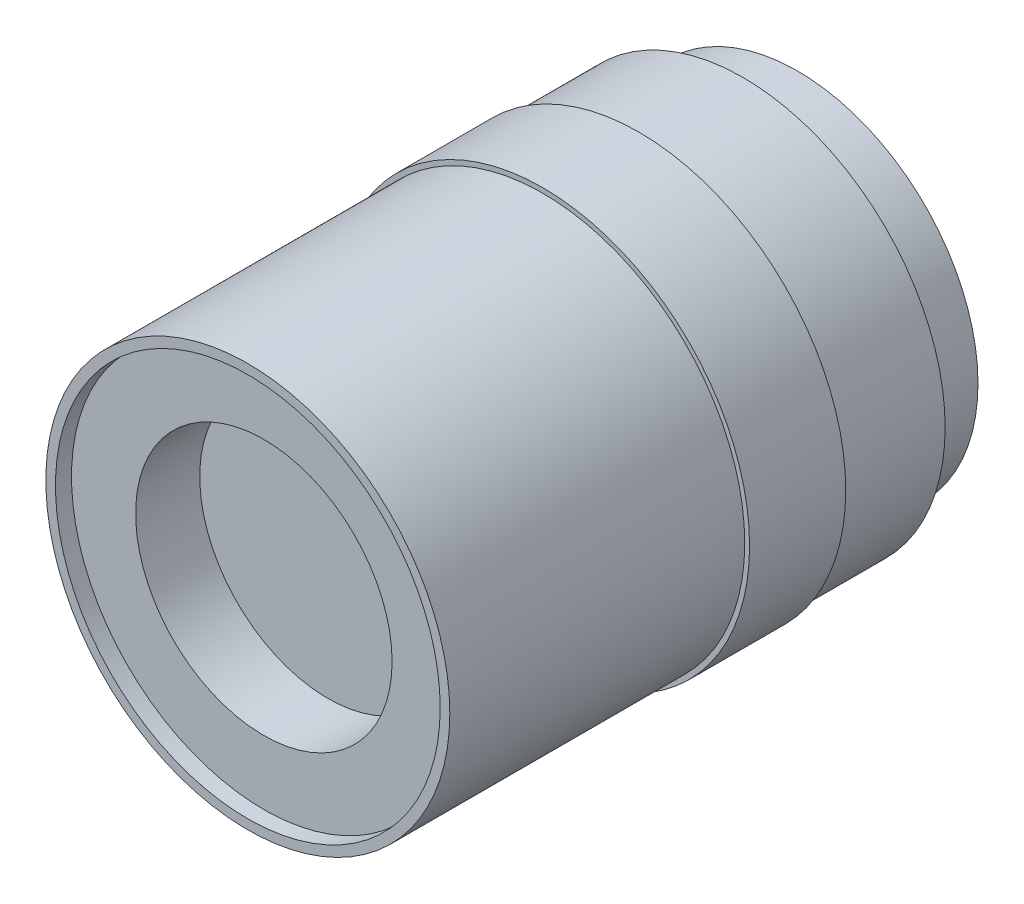
ISO-10303-21;
HEADER;
FILE_DESCRIPTION(('STEP AP214'),'2;1');
FILE_NAME('part.step','',(''),(''),'','','');
FILE_SCHEMA(('AUTOMOTIVE_DESIGN { 1 0 10303 214 1 1 1 1 }'));
ENDSEC;
DATA;
#1=APPLICATION_CONTEXT('core data for automotive mechanical design processes');
#2=APPLICATION_PROTOCOL_DEFINITION('international standard','automotive_design',2000,#1);
#3=PRODUCT_CONTEXT('',#1,'mechanical');
#4=PRODUCT('Part','Part','',(#3));
#5=PRODUCT_RELATED_PRODUCT_CATEGORY('part','',(#4));
#6=PRODUCT_DEFINITION_FORMATION('','',#4);
#7=PRODUCT_DEFINITION_CONTEXT('part definition',#1,'design');
#8=PRODUCT_DEFINITION('design','',#6,#7);
#9=PRODUCT_DEFINITION_SHAPE('','',#8);
#10=(LENGTH_UNIT() NAMED_UNIT(*) SI_UNIT(.MILLI.,.METRE.));
#11=(NAMED_UNIT(*) PLANE_ANGLE_UNIT() SI_UNIT($,.RADIAN.));
#12=(NAMED_UNIT(*) SI_UNIT($,.STERADIAN.) SOLID_ANGLE_UNIT());
#13=UNCERTAINTY_MEASURE_WITH_UNIT(LENGTH_MEASURE(1.E-05),#10,'distance_accuracy_value','');
#14=(GEOMETRIC_REPRESENTATION_CONTEXT(3) GLOBAL_UNCERTAINTY_ASSIGNED_CONTEXT((#13)) GLOBAL_UNIT_ASSIGNED_CONTEXT((#10,
#11,#12)) REPRESENTATION_CONTEXT('',''));
#15=CARTESIAN_POINT('',(0.,0.,0.));
#16=DIRECTION('',(0.,0.,1.));
#17=DIRECTION('',(1.,0.,0.));
#18=AXIS2_PLACEMENT_3D('',#15,#16,#17);
#19=CARTESIAN_POINT('',(0.,0.,20.193));
#20=DIRECTION('',(0.,0.,1.));
#21=DIRECTION('',(1.,0.,0.));
#22=AXIS2_PLACEMENT_3D('',#19,#20,#21);
#23=PLANE('',#22);
#24=CARTESIAN_POINT('',(0.,0.,20.193));
#25=DIRECTION('',(0.,0.,1.));
#26=DIRECTION('',(1.,0.,0.));
#27=AXIS2_PLACEMENT_3D('',#24,#25,#26);
#28=CIRCLE('',#27,16.383);
#29=CARTESIAN_POINT('',(16.383,0.,20.193));
#30=VERTEX_POINT('',#29);
#31=EDGE_CURVE('E52',#30,#30,#28,.T.);
#32=ORIENTED_EDGE('',*,*,#31,.T.);
#33=EDGE_LOOP('',(#32));
#34=FACE_BOUND('',#33,.T.);
#35=CARTESIAN_POINT('',(0.,0.,20.193));
#36=DIRECTION('',(0.,0.,1.));
#37=DIRECTION('',(1.,0.,0.));
#38=AXIS2_PLACEMENT_3D('',#35,#36,#37);
#39=CIRCLE('',#38,16.002);
#40=CARTESIAN_POINT('',(16.002,0.,20.193));
#41=VERTEX_POINT('',#40);
#42=EDGE_CURVE('E61',#41,#41,#39,.T.);
#43=ORIENTED_EDGE('',*,*,#42,.F.);
#44=EDGE_LOOP('',(#43));
#45=FACE_BOUND('',#44,.T.);
#46=ADVANCED_FACE('F32',(#34,#45),#23,.T.);
#47=CARTESIAN_POINT('',(0.,0.,4.318));
#48=DIRECTION('',(0.,0.,-1.));
#49=DIRECTION('',(-1.,0.,0.));
#50=AXIS2_PLACEMENT_3D('',#47,#48,#49);
#51=CYLINDRICAL_SURFACE('',#50,14.2875);
#52=CARTESIAN_POINT('',(0.,0.,4.318));
#53=DIRECTION('',(0.,0.,1.));
#54=DIRECTION('',(1.,0.,0.));
#55=AXIS2_PLACEMENT_3D('',#52,#53,#54);
#56=CIRCLE('',#55,14.2875);
#57=CARTESIAN_POINT('',(14.2875,0.,4.318));
#58=VERTEX_POINT('',#57);
#59=EDGE_CURVE('E10',#58,#58,#56,.T.);
#60=ORIENTED_EDGE('',*,*,#59,.F.);
#61=EDGE_LOOP('',(#60));
#62=FACE_BOUND('',#61,.T.);
#63=CARTESIAN_POINT('',(0.,0.,0.));
#64=DIRECTION('',(0.,0.,1.));
#65=DIRECTION('',(1.,0.,0.));
#66=AXIS2_PLACEMENT_3D('',#63,#64,#65);
#67=CIRCLE('',#66,14.2875);
#68=CARTESIAN_POINT('',(14.2875,0.,0.));
#69=VERTEX_POINT('',#68);
#70=EDGE_CURVE('E39',#69,#69,#67,.T.);
#71=ORIENTED_EDGE('',*,*,#70,.T.);
#72=EDGE_LOOP('',(#71));
#73=FACE_BOUND('',#72,.T.);
#74=ADVANCED_FACE('F34',(#62,#73),#51,.T.);
#75=CARTESIAN_POINT('',(0.,0.,0.));
#76=DIRECTION('',(0.,0.,1.));
#77=DIRECTION('',(1.,0.,0.));
#78=AXIS2_PLACEMENT_3D('',#75,#76,#77);
#79=PLANE('',#78);
#80=ORIENTED_EDGE('',*,*,#70,.F.);
#81=EDGE_LOOP('',(#80));
#82=FACE_BOUND('',#81,.T.);
#83=ADVANCED_FACE('F110',(#82),#79,.F.);
#84=CARTESIAN_POINT('',(0.,0.,4.318));
#85=DIRECTION('',(0.,0.,1.));
#86=DIRECTION('',(1.,0.,0.));
#87=AXIS2_PLACEMENT_3D('',#84,#85,#86);
#88=PLANE('',#87);
#89=CARTESIAN_POINT('',(0.,0.,4.318));
#90=DIRECTION('',(0.,0.,1.));
#91=DIRECTION('',(1.,0.,0.));
#92=AXIS2_PLACEMENT_3D('',#89,#90,#91);
#93=CIRCLE('',#92,16.002);
#94=CARTESIAN_POINT('',(16.002,0.,4.318));
#95=VERTEX_POINT('',#94);
#96=EDGE_CURVE('E47',#95,#95,#93,.T.);
#97=ORIENTED_EDGE('',*,*,#96,.F.);
#98=EDGE_LOOP('',(#97));
#99=FACE_BOUND('',#98,.T.);
#100=ORIENTED_EDGE('',*,*,#59,.T.);
#101=EDGE_LOOP('',(#100));
#102=FACE_BOUND('',#101,.T.);
#103=ADVANCED_FACE('F118',(#99,#102),#88,.F.);
#104=CARTESIAN_POINT('',(0.,0.,12.573));
#105=DIRECTION('',(0.,0.,-1.));
#106=DIRECTION('',(-1.,0.,0.));
#107=AXIS2_PLACEMENT_3D('',#104,#105,#106);
#108=CYLINDRICAL_SURFACE('',#107,16.002);
#109=CARTESIAN_POINT('',(0.,0.,12.573));
#110=DIRECTION('',(0.,0.,1.));
#111=DIRECTION('',(1.,0.,0.));
#112=AXIS2_PLACEMENT_3D('',#109,#110,#111);
#113=CIRCLE('',#112,16.002);
#114=CARTESIAN_POINT('',(16.002,0.,12.573));
#115=VERTEX_POINT('',#114);
#116=EDGE_CURVE('E43',#115,#115,#113,.T.);
#117=ORIENTED_EDGE('',*,*,#116,.F.);
#118=EDGE_LOOP('',(#117));
#119=FACE_BOUND('',#118,.T.);
#120=ORIENTED_EDGE('',*,*,#96,.T.);
#121=EDGE_LOOP('',(#120));
#122=FACE_BOUND('',#121,.T.);
#123=ADVANCED_FACE('F121',(#119,#122),#108,.T.);
#124=CARTESIAN_POINT('',(0.,0.,12.573));
#125=DIRECTION('',(0.,0.,1.));
#126=DIRECTION('',(1.,0.,0.));
#127=AXIS2_PLACEMENT_3D('',#124,#125,#126);
#128=PLANE('',#127);
#129=CARTESIAN_POINT('',(0.,0.,12.573));
#130=DIRECTION('',(0.,0.,1.));
#131=DIRECTION('',(1.,0.,0.));
#132=AXIS2_PLACEMENT_3D('',#129,#130,#131);
#133=CIRCLE('',#132,16.383);
#134=CARTESIAN_POINT('',(16.383,0.,12.573));
#135=VERTEX_POINT('',#134);
#136=EDGE_CURVE('E55',#135,#135,#133,.T.);
#137=ORIENTED_EDGE('',*,*,#136,.F.);
#138=EDGE_LOOP('',(#137));
#139=FACE_BOUND('',#138,.T.);
#140=ORIENTED_EDGE('',*,*,#116,.T.);
#141=EDGE_LOOP('',(#140));
#142=FACE_BOUND('',#141,.T.);
#143=ADVANCED_FACE('F114',(#139,#142),#128,.F.);
#144=CARTESIAN_POINT('',(0.,0.,20.193));
#145=DIRECTION('',(0.,0.,-1.));
#146=DIRECTION('',(-1.,0.,0.));
#147=AXIS2_PLACEMENT_3D('',#144,#145,#146);
#148=CYLINDRICAL_SURFACE('',#147,16.383);
#149=ORIENTED_EDGE('',*,*,#31,.F.);
#150=EDGE_LOOP('',(#149));
#151=FACE_BOUND('',#150,.T.);
#152=ORIENTED_EDGE('',*,*,#136,.T.);
#153=EDGE_LOOP('',(#152));
#154=FACE_BOUND('',#153,.T.);
#155=ADVANCED_FACE('F100',(#151,#154),#148,.T.);
#156=CARTESIAN_POINT('',(0.,0.,43.561));
#157=DIRECTION('',(0.,0.,-1.));
#158=DIRECTION('',(-1.,0.,0.));
#159=AXIS2_PLACEMENT_3D('',#156,#157,#158);
#160=CYLINDRICAL_SURFACE('',#159,16.002);
#161=CARTESIAN_POINT('',(0.,0.,43.561));
#162=DIRECTION('',(0.,0.,1.));
#163=DIRECTION('',(1.,0.,0.));
#164=AXIS2_PLACEMENT_3D('',#161,#162,#163);
#165=CIRCLE('',#164,16.002);
#166=CARTESIAN_POINT('',(16.002,0.,43.561));
#167=VERTEX_POINT('',#166);
#168=EDGE_CURVE('E58',#167,#167,#165,.T.);
#169=ORIENTED_EDGE('',*,*,#168,.F.);
#170=EDGE_LOOP('',(#169));
#171=FACE_BOUND('',#170,.T.);
#172=ORIENTED_EDGE('',*,*,#42,.T.);
#173=EDGE_LOOP('',(#172));
#174=FACE_BOUND('',#173,.T.);
#175=ADVANCED_FACE('F94',(#171,#174),#160,.T.);
#176=CARTESIAN_POINT('',(0.,0.,43.561));
#177=DIRECTION('',(0.,0.,1.));
#178=DIRECTION('',(1.,0.,0.));
#179=AXIS2_PLACEMENT_3D('',#176,#177,#178);
#180=PLANE('',#179);
#181=CARTESIAN_POINT('',(0.,0.,43.561));
#182=DIRECTION('',(0.,0.,1.));
#183=DIRECTION('',(1.,0.,0.));
#184=AXIS2_PLACEMENT_3D('',#181,#182,#183);
#185=CIRCLE('',#184,15.24);
#186=CARTESIAN_POINT('',(15.24,0.,43.561));
#187=VERTEX_POINT('',#186);
#188=EDGE_CURVE('E67',#187,#187,#185,.T.);
#189=ORIENTED_EDGE('',*,*,#188,.F.);
#190=EDGE_LOOP('',(#189));
#191=FACE_BOUND('',#190,.T.);
#192=ORIENTED_EDGE('',*,*,#168,.T.);
#193=EDGE_LOOP('',(#192));
#194=FACE_BOUND('',#193,.T.);
#195=ADVANCED_FACE('F88',(#191,#194),#180,.T.);
#196=CARTESIAN_POINT('',(0.,0.,42.291));
#197=DIRECTION('',(0.,0.,1.));
#198=DIRECTION('',(1.,0.,0.));
#199=AXIS2_PLACEMENT_3D('',#196,#197,#198);
#200=CYLINDRICAL_SURFACE('',#199,15.24);
#201=CARTESIAN_POINT('',(0.,0.,42.291));
#202=DIRECTION('',(0.,0.,1.));
#203=DIRECTION('',(1.,0.,0.));
#204=AXIS2_PLACEMENT_3D('',#201,#202,#203);
#205=CIRCLE('',#204,15.24);
#206=CARTESIAN_POINT('',(15.24,0.,42.291));
#207=VERTEX_POINT('',#206);
#208=EDGE_CURVE('E64',#207,#207,#205,.T.);
#209=ORIENTED_EDGE('',*,*,#208,.F.);
#210=EDGE_LOOP('',(#209));
#211=FACE_BOUND('',#210,.T.);
#212=ORIENTED_EDGE('',*,*,#188,.T.);
#213=EDGE_LOOP('',(#212));
#214=FACE_BOUND('',#213,.T.);
#215=ADVANCED_FACE('F82',(#211,#214),#200,.F.);
#216=CARTESIAN_POINT('',(0.,0.,42.291));
#217=DIRECTION('',(0.,0.,1.));
#218=DIRECTION('',(1.,0.,0.));
#219=AXIS2_PLACEMENT_3D('',#216,#217,#218);
#220=PLANE('',#219);
#221=CARTESIAN_POINT('',(0.,0.,42.291));
#222=DIRECTION('',(0.,0.,1.));
#223=DIRECTION('',(1.,0.,0.));
#224=AXIS2_PLACEMENT_3D('',#221,#222,#223);
#225=CIRCLE('',#224,10.16);
#226=CARTESIAN_POINT('',(10.16,0.,42.291));
#227=VERTEX_POINT('',#226);
#228=EDGE_CURVE('E73',#227,#227,#225,.T.);
#229=ORIENTED_EDGE('',*,*,#228,.F.);
#230=EDGE_LOOP('',(#229));
#231=FACE_BOUND('',#230,.T.);
#232=ORIENTED_EDGE('',*,*,#208,.T.);
#233=EDGE_LOOP('',(#232));
#234=FACE_BOUND('',#233,.T.);
#235=ADVANCED_FACE('F79',(#231,#234),#220,.T.);
#236=CARTESIAN_POINT('',(0.,0.,37.211));
#237=DIRECTION('',(0.,0.,1.));
#238=DIRECTION('',(1.,0.,0.));
#239=AXIS2_PLACEMENT_3D('',#236,#237,#238);
#240=CYLINDRICAL_SURFACE('',#239,10.16);
#241=CARTESIAN_POINT('',(0.,0.,37.211));
#242=DIRECTION('',(0.,0.,1.));
#243=DIRECTION('',(1.,0.,0.));
#244=AXIS2_PLACEMENT_3D('',#241,#242,#243);
#245=CIRCLE('',#244,10.16);
#246=CARTESIAN_POINT('',(10.16,0.,37.211));
#247=VERTEX_POINT('',#246);
#248=EDGE_CURVE('E70',#247,#247,#245,.T.);
#249=ORIENTED_EDGE('',*,*,#248,.F.);
#250=EDGE_LOOP('',(#249));
#251=FACE_BOUND('',#250,.T.);
#252=ORIENTED_EDGE('',*,*,#228,.T.);
#253=EDGE_LOOP('',(#252));
#254=FACE_BOUND('',#253,.T.);
#255=ADVANCED_FACE('F77',(#251,#254),#240,.F.);
#256=CARTESIAN_POINT('',(0.,0.,37.211));
#257=DIRECTION('',(0.,0.,1.));
#258=DIRECTION('',(1.,0.,0.));
#259=AXIS2_PLACEMENT_3D('',#256,#257,#258);
#260=PLANE('',#259);
#261=ORIENTED_EDGE('',*,*,#248,.T.);
#262=EDGE_LOOP('',(#261));
#263=FACE_BOUND('',#262,.T.);
#264=ADVANCED_FACE('F171',(#263),#260,.T.);
#265=CLOSED_SHELL('',(#46,#74,#83,#103,#123,#143,#155,#175,#195,#215,#235,#255,#264));
#266=MANIFOLD_SOLID_BREP('B2',#265);
#267=ADVANCED_BREP_SHAPE_REPRESENTATION('',(#18,#266),#14);
#268=SHAPE_DEFINITION_REPRESENTATION(#9,#267);
ENDSEC;
END-ISO-10303-21;
